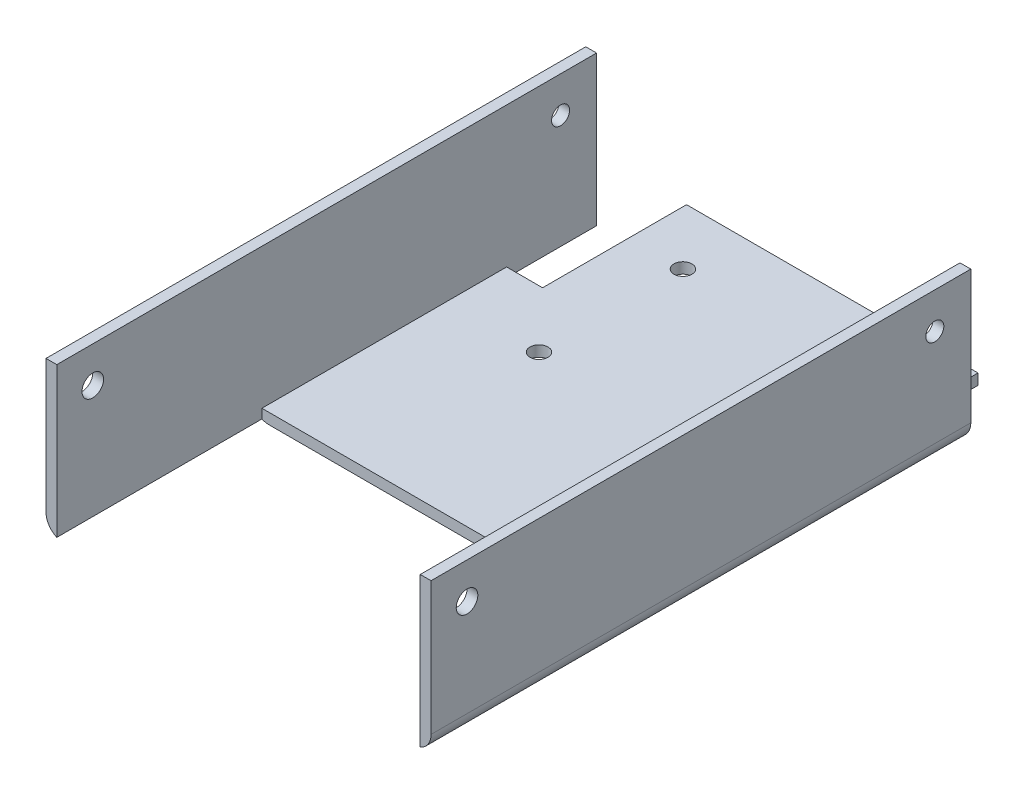
ISO-10303-21;
HEADER;
FILE_DESCRIPTION(('STEP AP214'),'2;1');
FILE_NAME('part.step','',(''),(''),'','','');
FILE_SCHEMA(('AUTOMOTIVE_DESIGN { 1 0 10303 214 1 1 1 1 }'));
ENDSEC;
DATA;
#1=APPLICATION_CONTEXT('core data for automotive mechanical design processes');
#2=APPLICATION_PROTOCOL_DEFINITION('international standard','automotive_design',2000,#1);
#3=PRODUCT_CONTEXT('',#1,'mechanical');
#4=PRODUCT('Part','Part','',(#3));
#5=PRODUCT_RELATED_PRODUCT_CATEGORY('part','',(#4));
#6=PRODUCT_DEFINITION_FORMATION('','',#4);
#7=PRODUCT_DEFINITION_CONTEXT('part definition',#1,'design');
#8=PRODUCT_DEFINITION('design','',#6,#7);
#9=PRODUCT_DEFINITION_SHAPE('','',#8);
#10=(LENGTH_UNIT() NAMED_UNIT(*) SI_UNIT(.MILLI.,.METRE.));
#11=(NAMED_UNIT(*) PLANE_ANGLE_UNIT() SI_UNIT($,.RADIAN.));
#12=(NAMED_UNIT(*) SI_UNIT($,.STERADIAN.) SOLID_ANGLE_UNIT());
#13=UNCERTAINTY_MEASURE_WITH_UNIT(LENGTH_MEASURE(1.E-05),#10,'distance_accuracy_value','');
#14=(GEOMETRIC_REPRESENTATION_CONTEXT(3) GLOBAL_UNCERTAINTY_ASSIGNED_CONTEXT((#13)) GLOBAL_UNIT_ASSIGNED_CONTEXT((#10,
#11,#12)) REPRESENTATION_CONTEXT('',''));
#15=CARTESIAN_POINT('',(0.,0.,0.));
#16=DIRECTION('',(0.,0.,1.));
#17=DIRECTION('',(1.,0.,0.));
#18=AXIS2_PLACEMENT_3D('',#15,#16,#17);
#19=CARTESIAN_POINT('',(0.,0.,165.));
#20=DIRECTION('',(0.,0.,1.));
#21=DIRECTION('',(1.,0.,0.));
#22=AXIS2_PLACEMENT_3D('',#19,#20,#21);
#23=PLANE('',#22);
#24=DIRECTION('',(0.,-1.,0.));
#25=VECTOR('',#24,1.);
#26=CARTESIAN_POINT('',(-45.2602249561635,-32.,165.));
#27=LINE('',#26,#25);
#28=CARTESIAN_POINT('',(-45.2602249561635,9.99999999999999,165.));
#29=VERTEX_POINT('',#28);
#30=CARTESIAN_POINT('',(-45.2602249561635,-27.,165.));
#31=VERTEX_POINT('',#30);
#32=EDGE_CURVE('E330',#29,#31,#27,.T.);
#33=ORIENTED_EDGE('',*,*,#32,.T.);
#34=CARTESIAN_POINT('',(-40.2602249561635,-27.,165.));
#35=DIRECTION('',(0.,0.,1.));
#36=DIRECTION('',(1.,0.,0.));
#37=AXIS2_PLACEMENT_3D('',#34,#35,#36);
#38=CIRCLE('',#37,5.);
#39=CARTESIAN_POINT('',(-42.2602249561635,-31.5825756949559,165.));
#40=VERTEX_POINT('',#39);
#41=EDGE_CURVE('E11',#31,#40,#38,.T.);
#42=ORIENTED_EDGE('',*,*,#41,.T.);
#43=DIRECTION('',(0.,1.,0.));
#44=VECTOR('',#43,1.);
#45=CARTESIAN_POINT('',(-42.2602249561635,10.,165.));
#46=LINE('',#45,#44);
#47=CARTESIAN_POINT('',(-42.2602249561635,10.,165.));
#48=VERTEX_POINT('',#47);
#49=EDGE_CURVE('E326',#40,#48,#46,.T.);
#50=ORIENTED_EDGE('',*,*,#49,.T.);
#51=DIRECTION('',(-1.,0.,0.));
#52=VECTOR('',#51,1.);
#53=CARTESIAN_POINT('',(-45.2602249561635,9.99999999999999,165.));
#54=LINE('',#53,#52);
#55=EDGE_CURVE('E328',#48,#29,#54,.T.);
#56=ORIENTED_EDGE('',*,*,#55,.T.);
#57=EDGE_LOOP('',(#33,#42,#50,#56));
#58=FACE_BOUND('',#57,.T.);
#59=ADVANCED_FACE('F37',(#58),#23,.T.);
#60=CARTESIAN_POINT('',(61.7397750438365,10.,165.));
#61=DIRECTION('',(0.,-1.,0.));
#62=DIRECTION('',(0.,0.,-1.));
#63=AXIS2_PLACEMENT_3D('',#60,#61,#62);
#64=PLANE('',#63);
#65=DIRECTION('',(0.,0.,-1.));
#66=VECTOR('',#65,1.);
#67=CARTESIAN_POINT('',(61.7397750438365,10.,165.));
#68=LINE('',#67,#66);
#69=CARTESIAN_POINT('',(61.7397750438365,10.,165.));
#70=VERTEX_POINT('',#69);
#71=CARTESIAN_POINT('',(61.7397750438365,10.,15.));
#72=VERTEX_POINT('',#71);
#73=EDGE_CURVE('E334',#70,#72,#68,.T.);
#74=ORIENTED_EDGE('',*,*,#73,.T.);
#75=DIRECTION('',(1.,0.,0.));
#76=VECTOR('',#75,1.);
#77=CARTESIAN_POINT('',(58.7397750438365,10.,15.));
#78=LINE('',#77,#76);
#79=CARTESIAN_POINT('',(58.7397750438365,10.,15.));
#80=VERTEX_POINT('',#79);
#81=EDGE_CURVE('E282',#80,#72,#78,.T.);
#82=ORIENTED_EDGE('',*,*,#81,.F.);
#83=DIRECTION('',(0.,0.,-1.));
#84=VECTOR('',#83,1.);
#85=CARTESIAN_POINT('',(58.7397750438365,10.,165.));
#86=LINE('',#85,#84);
#87=CARTESIAN_POINT('',(58.7397750438365,10.,165.));
#88=VERTEX_POINT('',#87);
#89=EDGE_CURVE('E193',#88,#80,#86,.T.);
#90=ORIENTED_EDGE('',*,*,#89,.F.);
#91=DIRECTION('',(-1.,0.,0.));
#92=VECTOR('',#91,1.);
#93=CARTESIAN_POINT('',(61.7397750438365,10.,165.));
#94=LINE('',#93,#92);
#95=EDGE_CURVE('E319',#70,#88,#94,.T.);
#96=ORIENTED_EDGE('',*,*,#95,.F.);
#97=EDGE_LOOP('',(#74,#82,#90,#96));
#98=FACE_BOUND('',#97,.T.);
#99=ADVANCED_FACE('F363',(#98),#64,.F.);
#100=CARTESIAN_POINT('',(58.7397750438365,10.,165.));
#101=DIRECTION('',(1.,0.,0.));
#102=DIRECTION('',(0.,1.,0.));
#103=AXIS2_PLACEMENT_3D('',#100,#101,#102);
#104=PLANE('',#103);
#105=CARTESIAN_POINT('',(58.7397750438365,0.,155.));
#106=DIRECTION('',(1.,0.,0.));
#107=DIRECTION('',(0.,1.,0.));
#108=AXIS2_PLACEMENT_3D('',#105,#106,#107);
#109=CIRCLE('',#108,2.99999999999999);
#110=CARTESIAN_POINT('',(58.7397750438365,2.99999999999999,155.));
#111=VERTEX_POINT('',#110);
#112=EDGE_CURVE('E268',#111,#111,#109,.T.);
#113=ORIENTED_EDGE('',*,*,#112,.T.);
#114=EDGE_LOOP('',(#113));
#115=FACE_BOUND('',#114,.T.);
#116=CARTESIAN_POINT('',(58.7397750438365,0.,25.));
#117=DIRECTION('',(1.,0.,0.));
#118=DIRECTION('',(0.,1.,0.));
#119=AXIS2_PLACEMENT_3D('',#116,#117,#118);
#120=CIRCLE('',#119,2.5);
#121=CARTESIAN_POINT('',(58.7397750438365,2.5,25.));
#122=VERTEX_POINT('',#121);
#123=EDGE_CURVE('E187',#122,#122,#120,.T.);
#124=ORIENTED_EDGE('',*,*,#123,.T.);
#125=EDGE_LOOP('',(#124));
#126=FACE_BOUND('',#125,.T.);
#127=DIRECTION('',(0.,1.,0.));
#128=VECTOR('',#127,1.);
#129=CARTESIAN_POINT('',(58.7397750438365,-155.,15.));
#130=LINE('',#129,#128);
#131=CARTESIAN_POINT('',(58.7397750438365,-31.5825756949558,15.));
#132=VERTEX_POINT('',#131);
#133=EDGE_CURVE('E288',#132,#80,#130,.T.);
#134=ORIENTED_EDGE('',*,*,#133,.F.);
#135=DIRECTION('',(0.,0.,-1.));
#136=VECTOR('',#135,1.);
#137=CARTESIAN_POINT('',(58.7397750438365,-31.5825756949558,15.));
#138=LINE('',#137,#136);
#139=CARTESIAN_POINT('',(58.7397750438365,-31.5825756949558,40.));
#140=VERTEX_POINT('',#139);
#141=EDGE_CURVE('E224',#132,#140,#138,.F.);
#142=ORIENTED_EDGE('',*,*,#141,.T.);
#143=DIRECTION('',(0.,1.,0.));
#144=VECTOR('',#143,1.);
#145=CARTESIAN_POINT('',(58.7397750438365,-194.,40.));
#146=LINE('',#145,#144);
#147=CARTESIAN_POINT('',(58.7397750438365,-29.,40.));
#148=VERTEX_POINT('',#147);
#149=EDGE_CURVE('E192',#140,#148,#146,.T.);
#150=ORIENTED_EDGE('',*,*,#149,.T.);
#151=DIRECTION('',(0.,0.,-1.));
#152=VECTOR('',#151,1.);
#153=CARTESIAN_POINT('',(58.7397750438365,-29.,165.));
#154=LINE('',#153,#152);
#155=CARTESIAN_POINT('',(58.7397750438365,-29.,108.));
#156=VERTEX_POINT('',#155);
#157=EDGE_CURVE('E182',#156,#148,#154,.T.);
#158=ORIENTED_EDGE('',*,*,#157,.F.);
#159=DIRECTION('',(0.,1.,0.));
#160=VECTOR('',#159,1.);
#161=CARTESIAN_POINT('',(58.7397750438365,-194.,108.));
#162=LINE('',#161,#160);
#163=CARTESIAN_POINT('',(58.7397750438365,-31.5825756949558,108.));
#164=VERTEX_POINT('',#163);
#165=EDGE_CURVE('E164',#164,#156,#162,.T.);
#166=ORIENTED_EDGE('',*,*,#165,.F.);
#167=DIRECTION('',(0.,0.,-1.));
#168=VECTOR('',#167,1.);
#169=CARTESIAN_POINT('',(58.7397750438365,-31.5825756949558,108.));
#170=LINE('',#169,#168);
#171=CARTESIAN_POINT('',(58.7397750438365,-31.5825756949558,165.));
#172=VERTEX_POINT('',#171);
#173=EDGE_CURVE('E222',#164,#172,#170,.F.);
#174=ORIENTED_EDGE('',*,*,#173,.T.);
#175=DIRECTION('',(0.,-1.,0.));
#176=VECTOR('',#175,1.);
#177=CARTESIAN_POINT('',(58.7397750438365,10.,165.));
#178=LINE('',#177,#176);
#179=EDGE_CURVE('E322',#88,#172,#178,.T.);
#180=ORIENTED_EDGE('',*,*,#179,.F.);
#181=ORIENTED_EDGE('',*,*,#89,.T.);
#182=EDGE_LOOP('',(#134,#142,#150,#158,#166,#174,#180,#181));
#183=FACE_BOUND('',#182,.T.);
#184=ADVANCED_FACE('F190',(#115,#126,#183),#104,.F.);
#185=CARTESIAN_POINT('',(-42.2602249561635,-29.,165.));
#186=DIRECTION('',(0.,-1.,0.));
#187=DIRECTION('',(1.,0.,0.));
#188=AXIS2_PLACEMENT_3D('',#185,#186,#187);
#189=PLANE('',#188);
#190=CARTESIAN_POINT('',(-17.2602249561635,-29.,16.));
#191=DIRECTION('',(0.,1.,0.));
#192=DIRECTION('',(0.,0.,1.));
#193=AXIS2_PLACEMENT_3D('',#190,#191,#192);
#194=CIRCLE('',#193,2.5);
#195=CARTESIAN_POINT('',(-17.2602249561635,-29.,18.5));
#196=VERTEX_POINT('',#195);
#197=EDGE_CURVE('E247',#196,#196,#194,.T.);
#198=ORIENTED_EDGE('',*,*,#197,.F.);
#199=EDGE_LOOP('',(#198));
#200=FACE_BOUND('',#199,.T.);
#201=CARTESIAN_POINT('',(-17.2602249561635,-29.,56.));
#202=DIRECTION('',(0.,1.,0.));
#203=DIRECTION('',(0.,0.,1.));
#204=AXIS2_PLACEMENT_3D('',#201,#202,#203);
#205=CIRCLE('',#204,2.5);
#206=CARTESIAN_POINT('',(-17.2602249561635,-29.,58.5));
#207=VERTEX_POINT('',#206);
#208=EDGE_CURVE('E253',#207,#207,#205,.T.);
#209=ORIENTED_EDGE('',*,*,#208,.F.);
#210=EDGE_LOOP('',(#209));
#211=FACE_BOUND('',#210,.T.);
#212=DIRECTION('',(0.,0.,-1.));
#213=VECTOR('',#212,1.);
#214=CARTESIAN_POINT('',(-42.2602249561635,-29.,165.));
#215=LINE('',#214,#213);
#216=CARTESIAN_POINT('',(-42.2602249561635,-29.,108.));
#217=VERTEX_POINT('',#216);
#218=CARTESIAN_POINT('',(-42.2602249561635,-29.,40.));
#219=VERTEX_POINT('',#218);
#220=EDGE_CURVE('E186',#217,#219,#215,.T.);
#221=ORIENTED_EDGE('',*,*,#220,.F.);
#222=DIRECTION('',(-1.,0.,0.));
#223=VECTOR('',#222,1.);
#224=CARTESIAN_POINT('',(-42.2602249561635,-29.,108.));
#225=LINE('',#224,#223);
#226=EDGE_CURVE('E169',#156,#217,#225,.T.);
#227=ORIENTED_EDGE('',*,*,#226,.F.);
#228=ORIENTED_EDGE('',*,*,#157,.T.);
#229=DIRECTION('',(1.,0.,0.));
#230=VECTOR('',#229,1.);
#231=CARTESIAN_POINT('',(58.7397750438365,-29.,40.));
#232=LINE('',#231,#230);
#233=CARTESIAN_POINT('',(48.7397750438365,-29.,40.));
#234=VERTEX_POINT('',#233);
#235=EDGE_CURVE('E308',#234,#148,#232,.T.);
#236=ORIENTED_EDGE('',*,*,#235,.F.);
#237=DIRECTION('',(0.,0.,1.));
#238=VECTOR('',#237,1.);
#239=CARTESIAN_POINT('',(48.7397750438365,-29.,0.));
#240=LINE('',#239,#238);
#241=CARTESIAN_POINT('',(48.7397750438365,-29.,0.));
#242=VERTEX_POINT('',#241);
#243=EDGE_CURVE('E291',#242,#234,#240,.T.);
#244=ORIENTED_EDGE('',*,*,#243,.F.);
#245=DIRECTION('',(-1.,0.,0.));
#246=VECTOR('',#245,1.);
#247=CARTESIAN_POINT('',(-42.2602249561635,-29.,0.));
#248=LINE('',#247,#246);
#249=CARTESIAN_POINT('',(-32.2602249561635,-29.,0.));
#250=VERTEX_POINT('',#249);
#251=EDGE_CURVE('E318',#242,#250,#248,.T.);
#252=ORIENTED_EDGE('',*,*,#251,.T.);
#253=DIRECTION('',(0.,0.,-1.));
#254=VECTOR('',#253,1.);
#255=CARTESIAN_POINT('',(-32.2602249561635,-29.,0.));
#256=LINE('',#255,#254);
#257=CARTESIAN_POINT('',(-32.2602249561635,-29.,40.));
#258=VERTEX_POINT('',#257);
#259=EDGE_CURVE('E299',#258,#250,#256,.T.);
#260=ORIENTED_EDGE('',*,*,#259,.F.);
#261=DIRECTION('',(1.,0.,0.));
#262=VECTOR('',#261,1.);
#263=CARTESIAN_POINT('',(-42.2602249561635,-29.,40.));
#264=LINE('',#263,#262);
#265=EDGE_CURVE('E296',#219,#258,#264,.T.);
#266=ORIENTED_EDGE('',*,*,#265,.F.);
#267=EDGE_LOOP('',(#221,#227,#228,#236,#244,#252,#260,#266));
#268=FACE_BOUND('',#267,.T.);
#269=ADVANCED_FACE('F180',(#200,#211,#268),#189,.F.);
#270=CARTESIAN_POINT('',(-42.2602249561635,10.,165.));
#271=DIRECTION('',(-1.,0.,0.));
#272=DIRECTION('',(0.,-1.,0.));
#273=AXIS2_PLACEMENT_3D('',#270,#271,#272);
#274=PLANE('',#273);
#275=CARTESIAN_POINT('',(-42.2602249561635,0.,155.));
#276=DIRECTION('',(-1.,0.,0.));
#277=DIRECTION('',(0.,-1.,0.));
#278=AXIS2_PLACEMENT_3D('',#275,#276,#277);
#279=CIRCLE('',#278,2.99999999999999);
#280=CARTESIAN_POINT('',(-42.2602249561635,-3.00000000000003,155.));
#281=VERTEX_POINT('',#280);
#282=EDGE_CURVE('E265',#281,#281,#279,.T.);
#283=ORIENTED_EDGE('',*,*,#282,.T.);
#284=EDGE_LOOP('',(#283));
#285=FACE_BOUND('',#284,.T.);
#286=CARTESIAN_POINT('',(-42.2602249561635,0.,25.));
#287=DIRECTION('',(-1.,0.,0.));
#288=DIRECTION('',(0.,-1.,0.));
#289=AXIS2_PLACEMENT_3D('',#286,#287,#288);
#290=CIRCLE('',#289,2.5);
#291=CARTESIAN_POINT('',(-42.2602249561635,-2.50000000000004,25.));
#292=VERTEX_POINT('',#291);
#293=EDGE_CURVE('E277',#292,#292,#290,.T.);
#294=ORIENTED_EDGE('',*,*,#293,.T.);
#295=EDGE_LOOP('',(#294));
#296=FACE_BOUND('',#295,.T.);
#297=DIRECTION('',(0.,1.,0.));
#298=VECTOR('',#297,1.);
#299=CARTESIAN_POINT('',(-42.2602249561635,-194.,40.));
#300=LINE('',#299,#298);
#301=CARTESIAN_POINT('',(-42.2602249561635,-31.5825756949558,40.));
#302=VERTEX_POINT('',#301);
#303=EDGE_CURVE('E301',#302,#219,#300,.T.);
#304=ORIENTED_EDGE('',*,*,#303,.F.);
#305=DIRECTION('',(0.,0.,-1.));
#306=VECTOR('',#305,1.);
#307=CARTESIAN_POINT('',(-42.2602249561635,-31.5825756949558,40.));
#308=LINE('',#307,#306);
#309=CARTESIAN_POINT('',(-42.2602249561635,-31.5825756949559,15.));
#310=VERTEX_POINT('',#309);
#311=EDGE_CURVE('E242',#302,#310,#308,.T.);
#312=ORIENTED_EDGE('',*,*,#311,.T.);
#313=DIRECTION('',(0.,1.,0.));
#314=VECTOR('',#313,1.);
#315=CARTESIAN_POINT('',(-42.2602249561635,-155.,15.));
#316=LINE('',#315,#314);
#317=CARTESIAN_POINT('',(-42.2602249561635,10.,15.));
#318=VERTEX_POINT('',#317);
#319=EDGE_CURVE('E289',#310,#318,#316,.T.);
#320=ORIENTED_EDGE('',*,*,#319,.T.);
#321=DIRECTION('',(0.,0.,-1.));
#322=VECTOR('',#321,1.);
#323=CARTESIAN_POINT('',(-42.2602249561635,10.,165.));
#324=LINE('',#323,#322);
#325=EDGE_CURVE('E198',#48,#318,#324,.T.);
#326=ORIENTED_EDGE('',*,*,#325,.F.);
#327=ORIENTED_EDGE('',*,*,#49,.F.);
#328=DIRECTION('',(0.,0.,-1.));
#329=VECTOR('',#328,1.);
#330=CARTESIAN_POINT('',(-42.2602249561635,-31.5825756949559,165.));
#331=LINE('',#330,#329);
#332=CARTESIAN_POINT('',(-42.2602249561635,-31.5825756949558,108.));
#333=VERTEX_POINT('',#332);
#334=EDGE_CURVE('E240',#40,#333,#331,.T.);
#335=ORIENTED_EDGE('',*,*,#334,.T.);
#336=DIRECTION('',(0.,1.,0.));
#337=VECTOR('',#336,1.);
#338=CARTESIAN_POINT('',(-42.2602249561635,-194.,108.));
#339=LINE('',#338,#337);
#340=EDGE_CURVE('E176',#333,#217,#339,.T.);
#341=ORIENTED_EDGE('',*,*,#340,.T.);
#342=ORIENTED_EDGE('',*,*,#220,.T.);
#343=EDGE_LOOP('',(#304,#312,#320,#326,#327,#335,#341,#342));
#344=FACE_BOUND('',#343,.T.);
#345=ADVANCED_FACE('F353',(#285,#296,#344),#274,.F.);
#346=CARTESIAN_POINT('',(-45.2602249561635,9.99999999999999,165.));
#347=DIRECTION('',(0.,-1.,0.));
#348=DIRECTION('',(1.,0.,0.));
#349=AXIS2_PLACEMENT_3D('',#346,#347,#348);
#350=PLANE('',#349);
#351=ORIENTED_EDGE('',*,*,#325,.T.);
#352=DIRECTION('',(1.,0.,0.));
#353=VECTOR('',#352,1.);
#354=CARTESIAN_POINT('',(-45.2602249561635,10.,15.));
#355=LINE('',#354,#353);
#356=CARTESIAN_POINT('',(-45.2602249561635,10.,15.));
#357=VERTEX_POINT('',#356);
#358=EDGE_CURVE('E284',#357,#318,#355,.T.);
#359=ORIENTED_EDGE('',*,*,#358,.F.);
#360=DIRECTION('',(0.,0.,-1.));
#361=VECTOR('',#360,1.);
#362=CARTESIAN_POINT('',(-45.2602249561635,9.99999999999999,165.));
#363=LINE('',#362,#361);
#364=EDGE_CURVE('E341',#29,#357,#363,.T.);
#365=ORIENTED_EDGE('',*,*,#364,.F.);
#366=ORIENTED_EDGE('',*,*,#55,.F.);
#367=EDGE_LOOP('',(#351,#359,#365,#366));
#368=FACE_BOUND('',#367,.T.);
#369=ADVANCED_FACE('F348',(#368),#350,.F.);
#370=CARTESIAN_POINT('',(-45.2602249561635,-32.,165.));
#371=DIRECTION('',(1.,0.,0.));
#372=DIRECTION('',(0.,0.,-1.));
#373=AXIS2_PLACEMENT_3D('',#370,#371,#372);
#374=PLANE('',#373);
#375=CARTESIAN_POINT('',(-45.2602249561635,0.,155.));
#376=DIRECTION('',(1.,0.,0.));
#377=DIRECTION('',(0.,0.,-1.));
#378=AXIS2_PLACEMENT_3D('',#375,#376,#377);
#379=CIRCLE('',#378,2.99999999999999);
#380=CARTESIAN_POINT('',(-45.2602249561635,0.,152.));
#381=VERTEX_POINT('',#380);
#382=EDGE_CURVE('E262',#381,#381,#379,.T.);
#383=ORIENTED_EDGE('',*,*,#382,.T.);
#384=EDGE_LOOP('',(#383));
#385=FACE_BOUND('',#384,.T.);
#386=CARTESIAN_POINT('',(-45.2602249561635,0.,25.));
#387=DIRECTION('',(1.,0.,0.));
#388=DIRECTION('',(0.,0.,-1.));
#389=AXIS2_PLACEMENT_3D('',#386,#387,#388);
#390=CIRCLE('',#389,2.5);
#391=CARTESIAN_POINT('',(-45.2602249561635,0.,22.5));
#392=VERTEX_POINT('',#391);
#393=EDGE_CURVE('E274',#392,#392,#390,.T.);
#394=ORIENTED_EDGE('',*,*,#393,.T.);
#395=EDGE_LOOP('',(#394));
#396=FACE_BOUND('',#395,.T.);
#397=DIRECTION('',(0.,1.,0.));
#398=VECTOR('',#397,1.);
#399=CARTESIAN_POINT('',(-45.2602249561635,-155.,15.));
#400=LINE('',#399,#398);
#401=CARTESIAN_POINT('',(-45.2602249561635,-27.,15.));
#402=VERTEX_POINT('',#401);
#403=EDGE_CURVE('E287',#402,#357,#400,.T.);
#404=ORIENTED_EDGE('',*,*,#403,.F.);
#405=DIRECTION('',(0.,0.,-1.));
#406=VECTOR('',#405,1.);
#407=CARTESIAN_POINT('',(-45.2602249561635,-27.,165.));
#408=LINE('',#407,#406);
#409=EDGE_CURVE('E46',#402,#31,#408,.F.);
#410=ORIENTED_EDGE('',*,*,#409,.T.);
#411=ORIENTED_EDGE('',*,*,#32,.F.);
#412=ORIENTED_EDGE('',*,*,#364,.T.);
#413=EDGE_LOOP('',(#404,#410,#411,#412));
#414=FACE_BOUND('',#413,.T.);
#415=ADVANCED_FACE('F357',(#385,#396,#414),#374,.F.);
#416=CARTESIAN_POINT('',(61.7397750438365,-32.,165.));
#417=DIRECTION('',(0.,1.,0.));
#418=DIRECTION('',(-1.,0.,0.));
#419=AXIS2_PLACEMENT_3D('',#416,#417,#418);
#420=PLANE('',#419);
#421=CARTESIAN_POINT('',(-17.2602249561635,-32.,16.));
#422=DIRECTION('',(0.,1.,0.));
#423=DIRECTION('',(-1.,0.,0.));
#424=AXIS2_PLACEMENT_3D('',#421,#422,#423);
#425=CIRCLE('',#424,2.5);
#426=CARTESIAN_POINT('',(-19.7602249561635,-32.,16.));
#427=VERTEX_POINT('',#426);
#428=EDGE_CURVE('E41',#427,#427,#425,.T.);
#429=ORIENTED_EDGE('',*,*,#428,.T.);
#430=EDGE_LOOP('',(#429));
#431=FACE_BOUND('',#430,.T.);
#432=CARTESIAN_POINT('',(-17.2602249561635,-32.,56.));
#433=DIRECTION('',(0.,1.,0.));
#434=DIRECTION('',(-1.,0.,0.));
#435=AXIS2_PLACEMENT_3D('',#432,#433,#434);
#436=CIRCLE('',#435,2.5);
#437=CARTESIAN_POINT('',(-19.7602249561635,-32.,56.));
#438=VERTEX_POINT('',#437);
#439=EDGE_CURVE('E245',#438,#438,#436,.T.);
#440=ORIENTED_EDGE('',*,*,#439,.T.);
#441=EDGE_LOOP('',(#440));
#442=FACE_BOUND('',#441,.T.);
#443=DIRECTION('',(1.,0.,0.));
#444=VECTOR('',#443,1.);
#445=CARTESIAN_POINT('',(61.7397750438365,-32.,40.));
#446=LINE('',#445,#444);
#447=CARTESIAN_POINT('',(48.7397750438365,-32.,40.));
#448=VERTEX_POINT('',#447);
#449=CARTESIAN_POINT('',(56.7397750438365,-32.,40.));
#450=VERTEX_POINT('',#449);
#451=EDGE_CURVE('E207',#448,#450,#446,.T.);
#452=ORIENTED_EDGE('',*,*,#451,.T.);
#453=DIRECTION('',(0.,0.,-1.));
#454=VECTOR('',#453,1.);
#455=CARTESIAN_POINT('',(56.7397750438365,-32.,165.));
#456=LINE('',#455,#454);
#457=CARTESIAN_POINT('',(56.7397750438365,-32.,108.));
#458=VERTEX_POINT('',#457);
#459=EDGE_CURVE('E231',#450,#458,#456,.F.);
#460=ORIENTED_EDGE('',*,*,#459,.T.);
#461=DIRECTION('',(-1.,0.,0.));
#462=VECTOR('',#461,1.);
#463=CARTESIAN_POINT('',(61.7397750438365,-32.,108.));
#464=LINE('',#463,#462);
#465=CARTESIAN_POINT('',(-40.2602249561635,-32.,108.));
#466=VERTEX_POINT('',#465);
#467=EDGE_CURVE('E214',#458,#466,#464,.T.);
#468=ORIENTED_EDGE('',*,*,#467,.T.);
#469=DIRECTION('',(0.,0.,-1.));
#470=VECTOR('',#469,1.);
#471=CARTESIAN_POINT('',(-40.2602249561635,-32.,165.));
#472=LINE('',#471,#470);
#473=CARTESIAN_POINT('',(-40.2602249561635,-32.,40.));
#474=VERTEX_POINT('',#473);
#475=EDGE_CURVE('E228',#466,#474,#472,.T.);
#476=ORIENTED_EDGE('',*,*,#475,.T.);
#477=DIRECTION('',(1.,0.,0.));
#478=VECTOR('',#477,1.);
#479=CARTESIAN_POINT('',(61.7397750438365,-32.,40.));
#480=LINE('',#479,#478);
#481=CARTESIAN_POINT('',(-32.2602249561635,-32.,40.));
#482=VERTEX_POINT('',#481);
#483=EDGE_CURVE('E210',#474,#482,#480,.T.);
#484=ORIENTED_EDGE('',*,*,#483,.T.);
#485=DIRECTION('',(0.,0.,-1.));
#486=VECTOR('',#485,1.);
#487=CARTESIAN_POINT('',(-32.2602249561635,-32.,165.));
#488=LINE('',#487,#486);
#489=CARTESIAN_POINT('',(-32.2602249561635,-32.,0.));
#490=VERTEX_POINT('',#489);
#491=EDGE_CURVE('E315',#482,#490,#488,.T.);
#492=ORIENTED_EDGE('',*,*,#491,.T.);
#493=DIRECTION('',(1.,0.,0.));
#494=VECTOR('',#493,1.);
#495=CARTESIAN_POINT('',(61.7397750438365,-32.,0.));
#496=LINE('',#495,#494);
#497=CARTESIAN_POINT('',(48.7397750438365,-32.,0.));
#498=VERTEX_POINT('',#497);
#499=EDGE_CURVE('E323',#490,#498,#496,.T.);
#500=ORIENTED_EDGE('',*,*,#499,.T.);
#501=DIRECTION('',(0.,0.,1.));
#502=VECTOR('',#501,1.);
#503=CARTESIAN_POINT('',(48.7397750438365,-32.,165.));
#504=LINE('',#503,#502);
#505=EDGE_CURVE('E304',#498,#448,#504,.T.);
#506=ORIENTED_EDGE('',*,*,#505,.T.);
#507=EDGE_LOOP('',(#452,#460,#468,#476,#484,#492,#500,#506));
#508=FACE_BOUND('',#507,.T.);
#509=ADVANCED_FACE('F383',(#431,#442,#508),#420,.F.);
#510=CARTESIAN_POINT('',(61.7397750438365,10.,165.));
#511=DIRECTION('',(-1.,0.,0.));
#512=DIRECTION('',(0.,-1.,0.));
#513=AXIS2_PLACEMENT_3D('',#510,#511,#512);
#514=PLANE('',#513);
#515=CARTESIAN_POINT('',(61.7397750438365,0.,155.));
#516=DIRECTION('',(1.,0.,0.));
#517=DIRECTION('',(0.,1.,0.));
#518=AXIS2_PLACEMENT_3D('',#515,#516,#517);
#519=CIRCLE('',#518,2.99999999999999);
#520=CARTESIAN_POINT('',(61.7397750438365,2.99999999999999,155.));
#521=VERTEX_POINT('',#520);
#522=EDGE_CURVE('E251',#521,#521,#519,.T.);
#523=ORIENTED_EDGE('',*,*,#522,.F.);
#524=EDGE_LOOP('',(#523));
#525=FACE_BOUND('',#524,.T.);
#526=CARTESIAN_POINT('',(61.7397750438365,0.,25.));
#527=DIRECTION('',(1.,0.,0.));
#528=DIRECTION('',(0.,1.,0.));
#529=AXIS2_PLACEMENT_3D('',#526,#527,#528);
#530=CIRCLE('',#529,2.5);
#531=CARTESIAN_POINT('',(61.7397750438365,2.5,25.));
#532=VERTEX_POINT('',#531);
#533=EDGE_CURVE('E271',#532,#532,#530,.T.);
#534=ORIENTED_EDGE('',*,*,#533,.F.);
#535=EDGE_LOOP('',(#534));
#536=FACE_BOUND('',#535,.T.);
#537=DIRECTION('',(0.,1.,0.));
#538=VECTOR('',#537,1.);
#539=CARTESIAN_POINT('',(61.7397750438365,10.,165.));
#540=LINE('',#539,#538);
#541=CARTESIAN_POINT('',(61.7397750438365,-27.,165.));
#542=VERTEX_POINT('',#541);
#543=EDGE_CURVE('E332',#542,#70,#540,.T.);
#544=ORIENTED_EDGE('',*,*,#543,.F.);
#545=DIRECTION('',(0.,0.,-1.));
#546=VECTOR('',#545,1.);
#547=CARTESIAN_POINT('',(61.7397750438365,-27.,165.));
#548=LINE('',#547,#546);
#549=CARTESIAN_POINT('',(61.7397750438365,-27.,15.));
#550=VERTEX_POINT('',#549);
#551=EDGE_CURVE('E217',#542,#550,#548,.T.);
#552=ORIENTED_EDGE('',*,*,#551,.T.);
#553=DIRECTION('',(0.,1.,0.));
#554=VECTOR('',#553,1.);
#555=CARTESIAN_POINT('',(61.7397750438365,10.,15.));
#556=LINE('',#555,#554);
#557=EDGE_CURVE('E212',#550,#72,#556,.T.);
#558=ORIENTED_EDGE('',*,*,#557,.T.);
#559=ORIENTED_EDGE('',*,*,#73,.F.);
#560=EDGE_LOOP('',(#544,#552,#558,#559));
#561=FACE_BOUND('',#560,.T.);
#562=ADVANCED_FACE('F375',(#525,#536,#561),#514,.F.);
#563=ORIENTED_EDGE('',*,*,#179,.T.);
#564=CARTESIAN_POINT('',(56.7397750438365,-27.,165.));
#565=DIRECTION('',(0.,0.,1.));
#566=DIRECTION('',(1.,0.,0.));
#567=AXIS2_PLACEMENT_3D('',#564,#565,#566);
#568=CIRCLE('',#567,5.);
#569=EDGE_CURVE('E236',#172,#542,#568,.T.);
#570=ORIENTED_EDGE('',*,*,#569,.T.);
#571=ORIENTED_EDGE('',*,*,#543,.T.);
#572=ORIENTED_EDGE('',*,*,#95,.T.);
#573=EDGE_LOOP('',(#563,#570,#571,#572));
#574=FACE_BOUND('',#573,.T.);
#575=ADVANCED_FACE('F365',(#574),#23,.T.);
#576=CARTESIAN_POINT('',(0.,0.,0.));
#577=DIRECTION('',(0.,0.,1.));
#578=DIRECTION('',(1.,0.,0.));
#579=AXIS2_PLACEMENT_3D('',#576,#577,#578);
#580=PLANE('',#579);
#581=ORIENTED_EDGE('',*,*,#499,.F.);
#582=DIRECTION('',(0.,1.,0.));
#583=VECTOR('',#582,1.);
#584=CARTESIAN_POINT('',(-32.2602249561635,0.,0.));
#585=LINE('',#584,#583);
#586=EDGE_CURVE('E204',#490,#250,#585,.T.);
#587=ORIENTED_EDGE('',*,*,#586,.T.);
#588=ORIENTED_EDGE('',*,*,#251,.F.);
#589=DIRECTION('',(0.,-1.,0.));
#590=VECTOR('',#589,1.);
#591=CARTESIAN_POINT('',(48.7397750438365,0.,0.));
#592=LINE('',#591,#590);
#593=EDGE_CURVE('E196',#242,#498,#592,.T.);
#594=ORIENTED_EDGE('',*,*,#593,.T.);
#595=EDGE_LOOP('',(#581,#587,#588,#594));
#596=FACE_BOUND('',#595,.T.);
#597=ADVANCED_FACE('F374',(#596),#580,.F.);
#598=CARTESIAN_POINT('',(58.7397750438365,-194.,40.));
#599=DIRECTION('',(0.,0.,1.));
#600=DIRECTION('',(1.,0.,0.));
#601=AXIS2_PLACEMENT_3D('',#598,#599,#600);
#602=PLANE('',#601);
#603=ORIENTED_EDGE('',*,*,#149,.F.);
#604=CARTESIAN_POINT('',(56.7397750438365,-27.,40.));
#605=DIRECTION('',(0.,0.,1.));
#606=DIRECTION('',(1.,0.,0.));
#607=AXIS2_PLACEMENT_3D('',#604,#605,#606);
#608=CIRCLE('',#607,5.);
#609=EDGE_CURVE('E226',#140,#450,#608,.F.);
#610=ORIENTED_EDGE('',*,*,#609,.T.);
#611=ORIENTED_EDGE('',*,*,#451,.F.);
#612=DIRECTION('',(0.,1.,0.));
#613=VECTOR('',#612,1.);
#614=CARTESIAN_POINT('',(48.7397750438365,-194.,40.));
#615=LINE('',#614,#613);
#616=EDGE_CURVE('E310',#448,#234,#615,.T.);
#617=ORIENTED_EDGE('',*,*,#616,.T.);
#618=ORIENTED_EDGE('',*,*,#235,.T.);
#619=EDGE_LOOP('',(#603,#610,#611,#617,#618));
#620=FACE_BOUND('',#619,.T.);
#621=ADVANCED_FACE('F381',(#620),#602,.F.);
#622=CARTESIAN_POINT('',(48.7397750438365,-194.,0.));
#623=DIRECTION('',(-1.,0.,0.));
#624=DIRECTION('',(0.,0.,1.));
#625=AXIS2_PLACEMENT_3D('',#622,#623,#624);
#626=PLANE('',#625);
#627=ORIENTED_EDGE('',*,*,#593,.F.);
#628=ORIENTED_EDGE('',*,*,#243,.T.);
#629=ORIENTED_EDGE('',*,*,#616,.F.);
#630=ORIENTED_EDGE('',*,*,#505,.F.);
#631=EDGE_LOOP('',(#627,#628,#629,#630));
#632=FACE_BOUND('',#631,.T.);
#633=ADVANCED_FACE('F407',(#632),#626,.F.);
#634=CARTESIAN_POINT('',(-42.2602249561635,-194.,40.));
#635=DIRECTION('',(0.,0.,1.));
#636=DIRECTION('',(1.,0.,0.));
#637=AXIS2_PLACEMENT_3D('',#634,#635,#636);
#638=PLANE('',#637);
#639=ORIENTED_EDGE('',*,*,#483,.F.);
#640=CARTESIAN_POINT('',(-40.2602249561635,-27.,40.));
#641=DIRECTION('',(0.,0.,1.));
#642=DIRECTION('',(1.,0.,0.));
#643=AXIS2_PLACEMENT_3D('',#640,#641,#642);
#644=CIRCLE('',#643,5.);
#645=EDGE_CURVE('E238',#474,#302,#644,.F.);
#646=ORIENTED_EDGE('',*,*,#645,.T.);
#647=ORIENTED_EDGE('',*,*,#303,.T.);
#648=ORIENTED_EDGE('',*,*,#265,.T.);
#649=DIRECTION('',(0.,1.,0.));
#650=VECTOR('',#649,1.);
#651=CARTESIAN_POINT('',(-32.2602249561635,-194.,40.));
#652=LINE('',#651,#650);
#653=EDGE_CURVE('E302',#482,#258,#652,.T.);
#654=ORIENTED_EDGE('',*,*,#653,.F.);
#655=EDGE_LOOP('',(#639,#646,#647,#648,#654));
#656=FACE_BOUND('',#655,.T.);
#657=ADVANCED_FACE('F417',(#656),#638,.F.);
#658=CARTESIAN_POINT('',(-32.2602249561635,-194.,0.));
#659=DIRECTION('',(1.,0.,0.));
#660=DIRECTION('',(0.,0.,-1.));
#661=AXIS2_PLACEMENT_3D('',#658,#659,#660);
#662=PLANE('',#661);
#663=ORIENTED_EDGE('',*,*,#653,.T.);
#664=ORIENTED_EDGE('',*,*,#259,.T.);
#665=ORIENTED_EDGE('',*,*,#586,.F.);
#666=ORIENTED_EDGE('',*,*,#491,.F.);
#667=EDGE_LOOP('',(#663,#664,#665,#666));
#668=FACE_BOUND('',#667,.T.);
#669=ADVANCED_FACE('F412',(#668),#662,.F.);
#670=CARTESIAN_POINT('',(58.7397750438365,-155.,15.));
#671=DIRECTION('',(0.,0.,1.));
#672=DIRECTION('',(1.,0.,0.));
#673=AXIS2_PLACEMENT_3D('',#670,#671,#672);
#674=PLANE('',#673);
#675=ORIENTED_EDGE('',*,*,#557,.F.);
#676=CARTESIAN_POINT('',(56.7397750438365,-27.,15.));
#677=DIRECTION('',(0.,0.,1.));
#678=DIRECTION('',(1.,0.,0.));
#679=AXIS2_PLACEMENT_3D('',#676,#677,#678);
#680=CIRCLE('',#679,5.);
#681=EDGE_CURVE('E220',#550,#132,#680,.F.);
#682=ORIENTED_EDGE('',*,*,#681,.T.);
#683=ORIENTED_EDGE('',*,*,#133,.T.);
#684=ORIENTED_EDGE('',*,*,#81,.T.);
#685=EDGE_LOOP('',(#675,#682,#683,#684));
#686=FACE_BOUND('',#685,.T.);
#687=ADVANCED_FACE('F398',(#686),#674,.F.);
#688=CARTESIAN_POINT('',(-45.2602249561635,-155.,15.));
#689=DIRECTION('',(0.,0.,1.));
#690=DIRECTION('',(1.,0.,0.));
#691=AXIS2_PLACEMENT_3D('',#688,#689,#690);
#692=PLANE('',#691);
#693=ORIENTED_EDGE('',*,*,#319,.F.);
#694=CARTESIAN_POINT('',(-40.2602249561635,-27.,15.));
#695=DIRECTION('',(0.,0.,1.));
#696=DIRECTION('',(1.,0.,0.));
#697=AXIS2_PLACEMENT_3D('',#694,#695,#696);
#698=CIRCLE('',#697,5.);
#699=EDGE_CURVE('E61',#310,#402,#698,.F.);
#700=ORIENTED_EDGE('',*,*,#699,.T.);
#701=ORIENTED_EDGE('',*,*,#403,.T.);
#702=ORIENTED_EDGE('',*,*,#358,.T.);
#703=EDGE_LOOP('',(#693,#700,#701,#702));
#704=FACE_BOUND('',#703,.T.);
#705=ADVANCED_FACE('F356',(#704),#692,.F.);
#706=CARTESIAN_POINT('',(-42.2602249561635,-194.,108.));
#707=DIRECTION('',(0.,0.,-1.));
#708=DIRECTION('',(-1.,0.,0.));
#709=AXIS2_PLACEMENT_3D('',#706,#707,#708);
#710=PLANE('',#709);
#711=ORIENTED_EDGE('',*,*,#467,.F.);
#712=CARTESIAN_POINT('',(56.7397750438365,-27.,108.));
#713=DIRECTION('',(0.,0.,-1.));
#714=DIRECTION('',(-1.,0.,0.));
#715=AXIS2_PLACEMENT_3D('',#712,#713,#714);
#716=CIRCLE('',#715,5.);
#717=EDGE_CURVE('E172',#458,#164,#716,.F.);
#718=ORIENTED_EDGE('',*,*,#717,.T.);
#719=ORIENTED_EDGE('',*,*,#165,.T.);
#720=ORIENTED_EDGE('',*,*,#226,.T.);
#721=ORIENTED_EDGE('',*,*,#340,.F.);
#722=CARTESIAN_POINT('',(-40.2602249561635,-27.,108.));
#723=DIRECTION('',(0.,0.,-1.));
#724=DIRECTION('',(-1.,0.,0.));
#725=AXIS2_PLACEMENT_3D('',#722,#723,#724);
#726=CIRCLE('',#725,5.);
#727=EDGE_CURVE('E233',#333,#466,#726,.F.);
#728=ORIENTED_EDGE('',*,*,#727,.T.);
#729=EDGE_LOOP('',(#711,#718,#719,#720,#721,#728));
#730=FACE_BOUND('',#729,.T.);
#731=ADVANCED_FACE('F167',(#730),#710,.F.);
#732=CARTESIAN_POINT('',(-103.260224956164,0.,25.));
#733=DIRECTION('',(1.,0.,0.));
#734=DIRECTION('',(0.,1.,0.));
#735=AXIS2_PLACEMENT_3D('',#732,#733,#734);
#736=CYLINDRICAL_SURFACE('',#735,2.5);
#737=ORIENTED_EDGE('',*,*,#533,.T.);
#738=EDGE_LOOP('',(#737));
#739=FACE_BOUND('',#738,.T.);
#740=ORIENTED_EDGE('',*,*,#123,.F.);
#741=EDGE_LOOP('',(#740));
#742=FACE_BOUND('',#741,.T.);
#743=ADVANCED_FACE('F473',(#739,#742),#736,.F.);
#744=ORIENTED_EDGE('',*,*,#393,.F.);
#745=EDGE_LOOP('',(#744));
#746=FACE_BOUND('',#745,.T.);
#747=ORIENTED_EDGE('',*,*,#293,.F.);
#748=EDGE_LOOP('',(#747));
#749=FACE_BOUND('',#748,.T.);
#750=ADVANCED_FACE('F478',(#746,#749),#736,.F.);
#751=CARTESIAN_POINT('',(56.7397750438365,-27.,165.));
#752=DIRECTION('',(0.,0.,-1.));
#753=DIRECTION('',(-1.,0.,0.));
#754=AXIS2_PLACEMENT_3D('',#751,#752,#753);
#755=CYLINDRICAL_SURFACE('',#754,5.);
#756=ORIENTED_EDGE('',*,*,#717,.F.);
#757=ORIENTED_EDGE('',*,*,#459,.F.);
#758=ORIENTED_EDGE('',*,*,#609,.F.);
#759=ORIENTED_EDGE('',*,*,#141,.F.);
#760=ORIENTED_EDGE('',*,*,#681,.F.);
#761=ORIENTED_EDGE('',*,*,#551,.F.);
#762=ORIENTED_EDGE('',*,*,#569,.F.);
#763=ORIENTED_EDGE('',*,*,#173,.F.);
#764=EDGE_LOOP('',(#756,#757,#758,#759,#760,#761,#762,#763));
#765=FACE_BOUND('',#764,.T.);
#766=ADVANCED_FACE('F392',(#765),#755,.T.);
#767=CARTESIAN_POINT('',(-40.2602249561635,-27.,165.));
#768=DIRECTION('',(0.,0.,-1.));
#769=DIRECTION('',(-1.,0.,0.));
#770=AXIS2_PLACEMENT_3D('',#767,#768,#769);
#771=CYLINDRICAL_SURFACE('',#770,5.);
#772=ORIENTED_EDGE('',*,*,#41,.F.);
#773=ORIENTED_EDGE('',*,*,#409,.F.);
#774=ORIENTED_EDGE('',*,*,#699,.F.);
#775=ORIENTED_EDGE('',*,*,#311,.F.);
#776=ORIENTED_EDGE('',*,*,#645,.F.);
#777=ORIENTED_EDGE('',*,*,#475,.F.);
#778=ORIENTED_EDGE('',*,*,#727,.F.);
#779=ORIENTED_EDGE('',*,*,#334,.F.);
#780=EDGE_LOOP('',(#772,#773,#774,#775,#776,#777,#778,#779));
#781=FACE_BOUND('',#780,.T.);
#782=ADVANCED_FACE('F39',(#781),#771,.T.);
#783=CARTESIAN_POINT('',(-48.2602249561635,0.,155.));
#784=DIRECTION('',(1.,0.,0.));
#785=DIRECTION('',(0.,1.,0.));
#786=AXIS2_PLACEMENT_3D('',#783,#784,#785);
#787=CYLINDRICAL_SURFACE('',#786,2.99999999999999);
#788=ORIENTED_EDGE('',*,*,#522,.T.);
#789=EDGE_LOOP('',(#788));
#790=FACE_BOUND('',#789,.T.);
#791=ORIENTED_EDGE('',*,*,#112,.F.);
#792=EDGE_LOOP('',(#791));
#793=FACE_BOUND('',#792,.T.);
#794=ADVANCED_FACE('F557',(#790,#793),#787,.F.);
#795=ORIENTED_EDGE('',*,*,#382,.F.);
#796=EDGE_LOOP('',(#795));
#797=FACE_BOUND('',#796,.T.);
#798=ORIENTED_EDGE('',*,*,#282,.F.);
#799=EDGE_LOOP('',(#798));
#800=FACE_BOUND('',#799,.T.);
#801=ADVANCED_FACE('F576',(#797,#800),#787,.F.);
#802=CARTESIAN_POINT('',(-17.2602249561635,-39.,56.));
#803=DIRECTION('',(0.,1.,0.));
#804=DIRECTION('',(0.,0.,1.));
#805=AXIS2_PLACEMENT_3D('',#802,#803,#804);
#806=CYLINDRICAL_SURFACE('',#805,2.5);
#807=ORIENTED_EDGE('',*,*,#208,.T.);
#808=EDGE_LOOP('',(#807));
#809=FACE_BOUND('',#808,.T.);
#810=ORIENTED_EDGE('',*,*,#439,.F.);
#811=EDGE_LOOP('',(#810));
#812=FACE_BOUND('',#811,.T.);
#813=ADVANCED_FACE('F589',(#809,#812),#806,.F.);
#814=CARTESIAN_POINT('',(-17.2602249561635,-39.,16.));
#815=DIRECTION('',(0.,1.,0.));
#816=DIRECTION('',(0.,0.,1.));
#817=AXIS2_PLACEMENT_3D('',#814,#815,#816);
#818=CYLINDRICAL_SURFACE('',#817,2.5);
#819=ORIENTED_EDGE('',*,*,#197,.T.);
#820=EDGE_LOOP('',(#819));
#821=FACE_BOUND('',#820,.T.);
#822=ORIENTED_EDGE('',*,*,#428,.F.);
#823=EDGE_LOOP('',(#822));
#824=FACE_BOUND('',#823,.T.);
#825=ADVANCED_FACE('F594',(#821,#824),#818,.F.);
#826=CLOSED_SHELL('',(#59,#99,#184,#269,#345,#369,#415,#509,#562,#575,#597,#621,#633,#657,#669,
#687,#705,#731,#743,#750,#766,#782,#794,#801,#813,#825));
#827=MANIFOLD_SOLID_BREP('B2',#826);
#828=ADVANCED_BREP_SHAPE_REPRESENTATION('',(#18,#827),#14);
#829=SHAPE_DEFINITION_REPRESENTATION(#9,#828);
ENDSEC;
END-ISO-10303-21;
